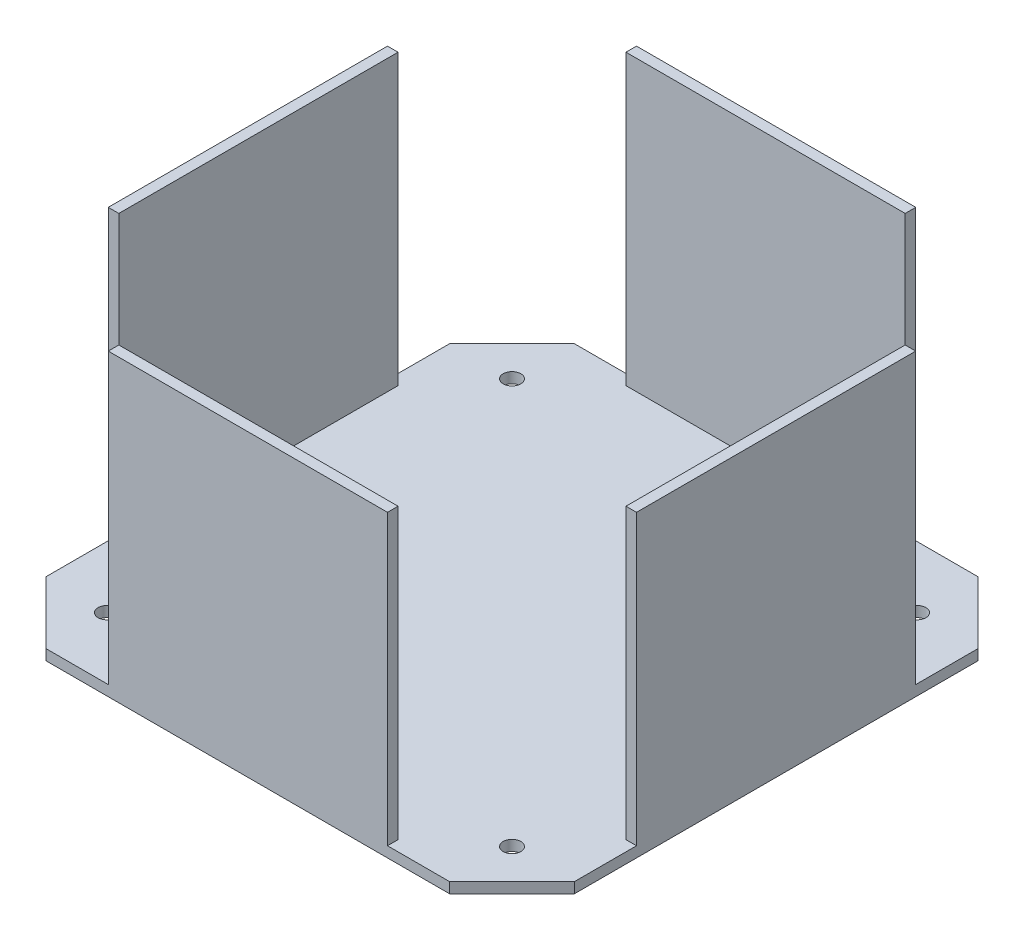
ISO-10303-21;
HEADER;
FILE_DESCRIPTION(('STEP AP214'),'2;1');
FILE_NAME('part.step','',(''),(''),'','','');
FILE_SCHEMA(('AUTOMOTIVE_DESIGN { 1 0 10303 214 1 1 1 1 }'));
ENDSEC;
DATA;
#1=APPLICATION_CONTEXT('core data for automotive mechanical design processes');
#2=APPLICATION_PROTOCOL_DEFINITION('international standard','automotive_design',2000,#1);
#3=PRODUCT_CONTEXT('',#1,'mechanical');
#4=PRODUCT('Part','Part','',(#3));
#5=PRODUCT_RELATED_PRODUCT_CATEGORY('part','',(#4));
#6=PRODUCT_DEFINITION_FORMATION('','',#4);
#7=PRODUCT_DEFINITION_CONTEXT('part definition',#1,'design');
#8=PRODUCT_DEFINITION('design','',#6,#7);
#9=PRODUCT_DEFINITION_SHAPE('','',#8);
#10=(LENGTH_UNIT() NAMED_UNIT(*) SI_UNIT(.MILLI.,.METRE.));
#11=(NAMED_UNIT(*) PLANE_ANGLE_UNIT() SI_UNIT($,.RADIAN.));
#12=(NAMED_UNIT(*) SI_UNIT($,.STERADIAN.) SOLID_ANGLE_UNIT());
#13=UNCERTAINTY_MEASURE_WITH_UNIT(LENGTH_MEASURE(1.E-05),#10,'distance_accuracy_value','');
#14=(GEOMETRIC_REPRESENTATION_CONTEXT(3) GLOBAL_UNCERTAINTY_ASSIGNED_CONTEXT((#13)) GLOBAL_UNIT_ASSIGNED_CONTEXT((#10,
#11,#12)) REPRESENTATION_CONTEXT('',''));
#15=CARTESIAN_POINT('',(0.,0.,0.));
#16=DIRECTION('',(0.,0.,1.));
#17=DIRECTION('',(1.,0.,0.));
#18=AXIS2_PLACEMENT_3D('',#15,#16,#17);
#19=CARTESIAN_POINT('',(0.,85.,0.));
#20=DIRECTION('',(0.,1.,0.));
#21=DIRECTION('',(0.,0.,1.));
#22=AXIS2_PLACEMENT_3D('',#19,#20,#21);
#23=PLANE('',#22);
#24=DIRECTION('',(1.,0.,0.));
#25=VECTOR('',#24,1.);
#26=CARTESIAN_POINT('',(75.,85.,-39.6446609406726));
#27=LINE('',#26,#25);
#28=CARTESIAN_POINT('',(72.,85.,-39.6446609406726));
#29=VERTEX_POINT('',#28);
#30=CARTESIAN_POINT('',(75.,85.,-39.6446609406726));
#31=VERTEX_POINT('',#30);
#32=EDGE_CURVE('E229',#29,#31,#27,.T.);
#33=ORIENTED_EDGE('',*,*,#32,.F.);
#34=DIRECTION('',(0.,0.,-1.));
#35=VECTOR('',#34,1.);
#36=CARTESIAN_POINT('',(72.,85.,75.));
#37=LINE('',#36,#35);
#38=CARTESIAN_POINT('',(72.,85.,39.6446609406727));
#39=VERTEX_POINT('',#38);
#40=EDGE_CURVE('E317',#39,#29,#37,.T.);
#41=ORIENTED_EDGE('',*,*,#40,.F.);
#42=DIRECTION('',(-1.,0.,0.));
#43=VECTOR('',#42,1.);
#44=CARTESIAN_POINT('',(75.,85.,39.6446609406727));
#45=LINE('',#44,#43);
#46=CARTESIAN_POINT('',(75.,85.,39.6446609406727));
#47=VERTEX_POINT('',#46);
#48=EDGE_CURVE('E287',#47,#39,#45,.T.);
#49=ORIENTED_EDGE('',*,*,#48,.F.);
#50=DIRECTION('',(0.,0.,-1.));
#51=VECTOR('',#50,1.);
#52=CARTESIAN_POINT('',(75.,85.,75.));
#53=LINE('',#52,#51);
#54=EDGE_CURVE('E48',#47,#31,#53,.T.);
#55=ORIENTED_EDGE('',*,*,#54,.T.);
#56=EDGE_LOOP('',(#33,#41,#49,#55));
#57=FACE_BOUND('',#56,.T.);
#58=ADVANCED_FACE('F39',(#57),#23,.T.);
#59=DIRECTION('',(0.,0.,1.));
#60=VECTOR('',#59,1.);
#61=CARTESIAN_POINT('',(39.6446609406727,85.,-75.));
#62=LINE('',#61,#60);
#63=CARTESIAN_POINT('',(39.6446609406727,85.,-75.));
#64=VERTEX_POINT('',#63);
#65=CARTESIAN_POINT('',(39.6446609406727,85.,-72.));
#66=VERTEX_POINT('',#65);
#67=EDGE_CURVE('E233',#64,#66,#62,.T.);
#68=ORIENTED_EDGE('',*,*,#67,.F.);
#69=DIRECTION('',(-1.,0.,0.));
#70=VECTOR('',#69,1.);
#71=CARTESIAN_POINT('',(75.,85.,-75.));
#72=LINE('',#71,#70);
#73=CARTESIAN_POINT('',(-39.6446609406726,85.,-75.));
#74=VERTEX_POINT('',#73);
#75=EDGE_CURVE('E11',#64,#74,#72,.T.);
#76=ORIENTED_EDGE('',*,*,#75,.T.);
#77=DIRECTION('',(0.,0.,-1.));
#78=VECTOR('',#77,1.);
#79=CARTESIAN_POINT('',(-39.6446609406726,85.,-75.));
#80=LINE('',#79,#78);
#81=CARTESIAN_POINT('',(-39.6446609406725,85.,-72.));
#82=VERTEX_POINT('',#81);
#83=EDGE_CURVE('E251',#82,#74,#80,.T.);
#84=ORIENTED_EDGE('',*,*,#83,.F.);
#85=DIRECTION('',(-1.,0.,0.));
#86=VECTOR('',#85,1.);
#87=CARTESIAN_POINT('',(75.,85.,-72.));
#88=LINE('',#87,#86);
#89=EDGE_CURVE('E320',#66,#82,#88,.T.);
#90=ORIENTED_EDGE('',*,*,#89,.F.);
#91=EDGE_LOOP('',(#68,#76,#84,#90));
#92=FACE_BOUND('',#91,.T.);
#93=ADVANCED_FACE('F434',(#92),#23,.T.);
#94=DIRECTION('',(1.,0.,0.));
#95=VECTOR('',#94,1.);
#96=CARTESIAN_POINT('',(-75.,85.,-39.6446609406727));
#97=LINE('',#96,#95);
#98=CARTESIAN_POINT('',(-75.,85.,-39.6446609406727));
#99=VERTEX_POINT('',#98);
#100=CARTESIAN_POINT('',(-72.,85.,-39.6446609406727));
#101=VERTEX_POINT('',#100);
#102=EDGE_CURVE('E241',#99,#101,#97,.T.);
#103=ORIENTED_EDGE('',*,*,#102,.F.);
#104=DIRECTION('',(0.,0.,1.));
#105=VECTOR('',#104,1.);
#106=CARTESIAN_POINT('',(-75.,85.,75.));
#107=LINE('',#106,#105);
#108=CARTESIAN_POINT('',(-75.,85.,39.6446609406726));
#109=VERTEX_POINT('',#108);
#110=EDGE_CURVE('E324',#99,#109,#107,.T.);
#111=ORIENTED_EDGE('',*,*,#110,.T.);
#112=DIRECTION('',(-1.,0.,0.));
#113=VECTOR('',#112,1.);
#114=CARTESIAN_POINT('',(-75.,85.,39.6446609406726));
#115=LINE('',#114,#113);
#116=CARTESIAN_POINT('',(-72.,85.,39.6446609406725));
#117=VERTEX_POINT('',#116);
#118=EDGE_CURVE('E288',#117,#109,#115,.T.);
#119=ORIENTED_EDGE('',*,*,#118,.F.);
#120=DIRECTION('',(0.,0.,1.));
#121=VECTOR('',#120,1.);
#122=CARTESIAN_POINT('',(-72.,85.,75.));
#123=LINE('',#122,#121);
#124=EDGE_CURVE('E311',#101,#117,#123,.T.);
#125=ORIENTED_EDGE('',*,*,#124,.F.);
#126=EDGE_LOOP('',(#103,#111,#119,#125));
#127=FACE_BOUND('',#126,.T.);
#128=ADVANCED_FACE('F440',(#127),#23,.T.);
#129=CARTESIAN_POINT('',(-75.,85.,75.));
#130=DIRECTION('',(1.,0.,0.));
#131=DIRECTION('',(0.,0.,-1.));
#132=AXIS2_PLACEMENT_3D('',#129,#130,#131);
#133=PLANE('',#132);
#134=DIRECTION('',(0.,0.,-1.));
#135=VECTOR('',#134,1.);
#136=CARTESIAN_POINT('',(-75.,3.,-75.));
#137=LINE('',#136,#135);
#138=CARTESIAN_POINT('',(-75.,3.,-39.6446609406727));
#139=VERTEX_POINT('',#138);
#140=CARTESIAN_POINT('',(-75.,3.,-57.3223304703363));
#141=VERTEX_POINT('',#140);
#142=EDGE_CURVE('E249',#139,#141,#137,.T.);
#143=ORIENTED_EDGE('',*,*,#142,.T.);
#144=DIRECTION('',(0.,1.,0.));
#145=VECTOR('',#144,1.);
#146=CARTESIAN_POINT('',(-75.,0.,-57.3223304703363));
#147=LINE('',#146,#145);
#148=CARTESIAN_POINT('',(-75.,0.,-57.3223304703363));
#149=VERTEX_POINT('',#148);
#150=EDGE_CURVE('E207',#149,#141,#147,.T.);
#151=ORIENTED_EDGE('',*,*,#150,.F.);
#152=DIRECTION('',(0.,0.,1.));
#153=VECTOR('',#152,1.);
#154=CARTESIAN_POINT('',(-75.,0.,75.));
#155=LINE('',#154,#153);
#156=CARTESIAN_POINT('',(-75.,0.,57.3223304703363));
#157=VERTEX_POINT('',#156);
#158=EDGE_CURVE('E323',#149,#157,#155,.T.);
#159=ORIENTED_EDGE('',*,*,#158,.T.);
#160=DIRECTION('',(0.,1.,0.));
#161=VECTOR('',#160,1.);
#162=CARTESIAN_POINT('',(-75.,0.,57.3223304703363));
#163=LINE('',#162,#161);
#164=CARTESIAN_POINT('',(-75.,3.,57.3223304703363));
#165=VERTEX_POINT('',#164);
#166=EDGE_CURVE('E367',#157,#165,#163,.T.);
#167=ORIENTED_EDGE('',*,*,#166,.T.);
#168=DIRECTION('',(0.,0.,-1.));
#169=VECTOR('',#168,1.);
#170=CARTESIAN_POINT('',(-75.,3.,39.6446609406726));
#171=LINE('',#170,#169);
#172=CARTESIAN_POINT('',(-75.,3.,39.6446609406726));
#173=VERTEX_POINT('',#172);
#174=EDGE_CURVE('E252',#165,#173,#171,.T.);
#175=ORIENTED_EDGE('',*,*,#174,.T.);
#176=DIRECTION('',(0.,1.,0.));
#177=VECTOR('',#176,1.);
#178=CARTESIAN_POINT('',(-75.,-47.,39.6446609406726));
#179=LINE('',#178,#177);
#180=EDGE_CURVE('E374',#173,#109,#179,.T.);
#181=ORIENTED_EDGE('',*,*,#180,.T.);
#182=ORIENTED_EDGE('',*,*,#110,.F.);
#183=DIRECTION('',(0.,1.,0.));
#184=VECTOR('',#183,1.);
#185=CARTESIAN_POINT('',(-75.,-47.,-39.6446609406727));
#186=LINE('',#185,#184);
#187=EDGE_CURVE('E242',#139,#99,#186,.T.);
#188=ORIENTED_EDGE('',*,*,#187,.F.);
#189=EDGE_LOOP('',(#143,#151,#159,#167,#175,#181,#182,#188));
#190=FACE_BOUND('',#189,.T.);
#191=ADVANCED_FACE('F41',(#190),#133,.F.);
#192=CARTESIAN_POINT('',(75.,85.,75.));
#193=DIRECTION('',(0.,0.,-1.));
#194=DIRECTION('',(-1.,0.,0.));
#195=AXIS2_PLACEMENT_3D('',#192,#193,#194);
#196=PLANE('',#195);
#197=DIRECTION('',(1.,0.,0.));
#198=VECTOR('',#197,1.);
#199=CARTESIAN_POINT('',(75.,0.,75.));
#200=LINE('',#199,#198);
#201=CARTESIAN_POINT('',(-57.3223304703363,0.,75.));
#202=VERTEX_POINT('',#201);
#203=CARTESIAN_POINT('',(57.3223304703363,0.,75.));
#204=VERTEX_POINT('',#203);
#205=EDGE_CURVE('E334',#202,#204,#200,.T.);
#206=ORIENTED_EDGE('',*,*,#205,.T.);
#207=DIRECTION('',(0.,1.,0.));
#208=VECTOR('',#207,1.);
#209=CARTESIAN_POINT('',(57.3223304703363,0.,75.));
#210=LINE('',#209,#208);
#211=CARTESIAN_POINT('',(57.3223304703363,3.,75.));
#212=VERTEX_POINT('',#211);
#213=EDGE_CURVE('E357',#204,#212,#210,.T.);
#214=ORIENTED_EDGE('',*,*,#213,.T.);
#215=DIRECTION('',(-1.,0.,0.));
#216=VECTOR('',#215,1.);
#217=CARTESIAN_POINT('',(39.6446609406725,3.,75.));
#218=LINE('',#217,#216);
#219=CARTESIAN_POINT('',(39.6446609406725,3.,75.));
#220=VERTEX_POINT('',#219);
#221=EDGE_CURVE('E284',#212,#220,#218,.T.);
#222=ORIENTED_EDGE('',*,*,#221,.T.);
#223=DIRECTION('',(0.,1.,0.));
#224=VECTOR('',#223,1.);
#225=CARTESIAN_POINT('',(39.6446609406725,-47.,75.));
#226=LINE('',#225,#224);
#227=CARTESIAN_POINT('',(39.6446609406725,85.,75.));
#228=VERTEX_POINT('',#227);
#229=EDGE_CURVE('E290',#220,#228,#226,.T.);
#230=ORIENTED_EDGE('',*,*,#229,.T.);
#231=DIRECTION('',(1.,0.,0.));
#232=VECTOR('',#231,1.);
#233=CARTESIAN_POINT('',(75.,85.,75.));
#234=LINE('',#233,#232);
#235=CARTESIAN_POINT('',(-39.6446609406727,85.,75.));
#236=VERTEX_POINT('',#235);
#237=EDGE_CURVE('E327',#236,#228,#234,.T.);
#238=ORIENTED_EDGE('',*,*,#237,.F.);
#239=DIRECTION('',(0.,1.,0.));
#240=VECTOR('',#239,1.);
#241=CARTESIAN_POINT('',(-39.6446609406727,-47.,75.));
#242=LINE('',#241,#240);
#243=CARTESIAN_POINT('',(-39.6446609406727,3.,75.));
#244=VERTEX_POINT('',#243);
#245=EDGE_CURVE('E378',#244,#236,#242,.T.);
#246=ORIENTED_EDGE('',*,*,#245,.F.);
#247=DIRECTION('',(-1.,0.,0.));
#248=VECTOR('',#247,1.);
#249=CARTESIAN_POINT('',(-75.,3.,75.));
#250=LINE('',#249,#248);
#251=CARTESIAN_POINT('',(-57.3223304703363,3.,75.));
#252=VERTEX_POINT('',#251);
#253=EDGE_CURVE('E237',#244,#252,#250,.T.);
#254=ORIENTED_EDGE('',*,*,#253,.T.);
#255=DIRECTION('',(0.,1.,0.));
#256=VECTOR('',#255,1.);
#257=CARTESIAN_POINT('',(-57.3223304703363,0.,75.));
#258=LINE('',#257,#256);
#259=EDGE_CURVE('E259',#202,#252,#258,.T.);
#260=ORIENTED_EDGE('',*,*,#259,.F.);
#261=EDGE_LOOP('',(#206,#214,#222,#230,#238,#246,#254,#260));
#262=FACE_BOUND('',#261,.T.);
#263=ADVANCED_FACE('F395',(#262),#196,.F.);
#264=CARTESIAN_POINT('',(75.,85.,75.));
#265=DIRECTION('',(-1.,0.,0.));
#266=DIRECTION('',(0.,0.,1.));
#267=AXIS2_PLACEMENT_3D('',#264,#265,#266);
#268=PLANE('',#267);
#269=DIRECTION('',(0.,0.,1.));
#270=VECTOR('',#269,1.);
#271=CARTESIAN_POINT('',(75.,3.,75.));
#272=LINE('',#271,#270);
#273=CARTESIAN_POINT('',(75.,3.,39.6446609406727));
#274=VERTEX_POINT('',#273);
#275=CARTESIAN_POINT('',(75.,3.,57.3223304703363));
#276=VERTEX_POINT('',#275);
#277=EDGE_CURVE('E276',#274,#276,#272,.T.);
#278=ORIENTED_EDGE('',*,*,#277,.T.);
#279=DIRECTION('',(0.,1.,0.));
#280=VECTOR('',#279,1.);
#281=CARTESIAN_POINT('',(75.,0.,57.3223304703363));
#282=LINE('',#281,#280);
#283=CARTESIAN_POINT('',(75.,0.,57.3223304703363));
#284=VERTEX_POINT('',#283);
#285=EDGE_CURVE('E64',#284,#276,#282,.T.);
#286=ORIENTED_EDGE('',*,*,#285,.F.);
#287=DIRECTION('',(0.,0.,-1.));
#288=VECTOR('',#287,1.);
#289=CARTESIAN_POINT('',(75.,0.,75.));
#290=LINE('',#289,#288);
#291=CARTESIAN_POINT('',(75.,0.,-57.3223304703363));
#292=VERTEX_POINT('',#291);
#293=EDGE_CURVE('E336',#284,#292,#290,.T.);
#294=ORIENTED_EDGE('',*,*,#293,.T.);
#295=DIRECTION('',(0.,1.,0.));
#296=VECTOR('',#295,1.);
#297=CARTESIAN_POINT('',(75.,0.,-57.3223304703363));
#298=LINE('',#297,#296);
#299=CARTESIAN_POINT('',(75.,3.,-57.3223304703363));
#300=VERTEX_POINT('',#299);
#301=EDGE_CURVE('E342',#292,#300,#298,.T.);
#302=ORIENTED_EDGE('',*,*,#301,.T.);
#303=DIRECTION('',(0.,0.,1.));
#304=VECTOR('',#303,1.);
#305=CARTESIAN_POINT('',(75.,3.,-39.6446609406726));
#306=LINE('',#305,#304);
#307=CARTESIAN_POINT('',(75.,3.,-39.6446609406726));
#308=VERTEX_POINT('',#307);
#309=EDGE_CURVE('E256',#300,#308,#306,.T.);
#310=ORIENTED_EDGE('',*,*,#309,.T.);
#311=DIRECTION('',(0.,1.,0.));
#312=VECTOR('',#311,1.);
#313=CARTESIAN_POINT('',(75.,-47.,-39.6446609406726));
#314=LINE('',#313,#312);
#315=EDGE_CURVE('E260',#308,#31,#314,.T.);
#316=ORIENTED_EDGE('',*,*,#315,.T.);
#317=ORIENTED_EDGE('',*,*,#54,.F.);
#318=DIRECTION('',(0.,1.,0.));
#319=VECTOR('',#318,1.);
#320=CARTESIAN_POINT('',(75.,-47.,39.6446609406727));
#321=LINE('',#320,#319);
#322=EDGE_CURVE('E295',#274,#47,#321,.T.);
#323=ORIENTED_EDGE('',*,*,#322,.F.);
#324=EDGE_LOOP('',(#278,#286,#294,#302,#310,#316,#317,#323));
#325=FACE_BOUND('',#324,.T.);
#326=ADVANCED_FACE('F341',(#325),#268,.F.);
#327=CARTESIAN_POINT('',(75.,85.,-75.));
#328=DIRECTION('',(0.,0.,1.));
#329=DIRECTION('',(1.,0.,0.));
#330=AXIS2_PLACEMENT_3D('',#327,#328,#329);
#331=PLANE('',#330);
#332=DIRECTION('',(1.,0.,0.));
#333=VECTOR('',#332,1.);
#334=CARTESIAN_POINT('',(75.,3.,-75.));
#335=LINE('',#334,#333);
#336=CARTESIAN_POINT('',(39.6446609406727,3.,-75.));
#337=VERTEX_POINT('',#336);
#338=CARTESIAN_POINT('',(57.3223304703363,3.,-75.));
#339=VERTEX_POINT('',#338);
#340=EDGE_CURVE('E270',#337,#339,#335,.T.);
#341=ORIENTED_EDGE('',*,*,#340,.T.);
#342=DIRECTION('',(0.,1.,0.));
#343=VECTOR('',#342,1.);
#344=CARTESIAN_POINT('',(57.3223304703363,0.,-75.));
#345=LINE('',#344,#343);
#346=CARTESIAN_POINT('',(57.3223304703363,0.,-75.));
#347=VERTEX_POINT('',#346);
#348=EDGE_CURVE('E56',#347,#339,#345,.T.);
#349=ORIENTED_EDGE('',*,*,#348,.F.);
#350=DIRECTION('',(-1.,0.,0.));
#351=VECTOR('',#350,1.);
#352=CARTESIAN_POINT('',(75.,0.,-75.));
#353=LINE('',#352,#351);
#354=CARTESIAN_POINT('',(-57.3223304703362,0.,-75.));
#355=VERTEX_POINT('',#354);
#356=EDGE_CURVE('E43',#347,#355,#353,.T.);
#357=ORIENTED_EDGE('',*,*,#356,.T.);
#358=DIRECTION('',(0.,1.,0.));
#359=VECTOR('',#358,1.);
#360=CARTESIAN_POINT('',(-57.3223304703362,0.,-75.));
#361=LINE('',#360,#359);
#362=CARTESIAN_POINT('',(-57.3223304703362,3.,-75.));
#363=VERTEX_POINT('',#362);
#364=EDGE_CURVE('E204',#355,#363,#361,.T.);
#365=ORIENTED_EDGE('',*,*,#364,.T.);
#366=DIRECTION('',(1.,0.,0.));
#367=VECTOR('',#366,1.);
#368=CARTESIAN_POINT('',(-39.6446609406726,3.,-75.));
#369=LINE('',#368,#367);
#370=CARTESIAN_POINT('',(-39.6446609406726,3.,-75.));
#371=VERTEX_POINT('',#370);
#372=EDGE_CURVE('E220',#363,#371,#369,.T.);
#373=ORIENTED_EDGE('',*,*,#372,.T.);
#374=DIRECTION('',(0.,1.,0.));
#375=VECTOR('',#374,1.);
#376=CARTESIAN_POINT('',(-39.6446609406726,-47.,-75.));
#377=LINE('',#376,#375);
#378=EDGE_CURVE('E239',#371,#74,#377,.T.);
#379=ORIENTED_EDGE('',*,*,#378,.T.);
#380=ORIENTED_EDGE('',*,*,#75,.F.);
#381=DIRECTION('',(0.,1.,0.));
#382=VECTOR('',#381,1.);
#383=CARTESIAN_POINT('',(39.6446609406727,-47.,-75.));
#384=LINE('',#383,#382);
#385=EDGE_CURVE('E263',#337,#64,#384,.T.);
#386=ORIENTED_EDGE('',*,*,#385,.F.);
#387=EDGE_LOOP('',(#341,#349,#357,#365,#373,#379,#380,#386));
#388=FACE_BOUND('',#387,.T.);
#389=ADVANCED_FACE('F218',(#388),#331,.F.);
#390=DIRECTION('',(0.,0.,-1.));
#391=VECTOR('',#390,1.);
#392=CARTESIAN_POINT('',(-39.6446609406727,85.,75.));
#393=LINE('',#392,#391);
#394=CARTESIAN_POINT('',(-39.6446609406727,85.,72.));
#395=VERTEX_POINT('',#394);
#396=EDGE_CURVE('E377',#236,#395,#393,.T.);
#397=ORIENTED_EDGE('',*,*,#396,.F.);
#398=ORIENTED_EDGE('',*,*,#237,.T.);
#399=DIRECTION('',(0.,0.,1.));
#400=VECTOR('',#399,1.);
#401=CARTESIAN_POINT('',(39.6446609406725,85.,75.));
#402=LINE('',#401,#400);
#403=CARTESIAN_POINT('',(39.6446609406725,85.,72.));
#404=VERTEX_POINT('',#403);
#405=EDGE_CURVE('E285',#404,#228,#402,.T.);
#406=ORIENTED_EDGE('',*,*,#405,.F.);
#407=DIRECTION('',(1.,0.,0.));
#408=VECTOR('',#407,1.);
#409=CARTESIAN_POINT('',(75.,85.,72.));
#410=LINE('',#409,#408);
#411=EDGE_CURVE('E314',#395,#404,#410,.T.);
#412=ORIENTED_EDGE('',*,*,#411,.F.);
#413=EDGE_LOOP('',(#397,#398,#406,#412));
#414=FACE_BOUND('',#413,.T.);
#415=ADVANCED_FACE('F415',(#414),#23,.T.);
#416=CARTESIAN_POINT('',(0.,0.,0.));
#417=DIRECTION('',(0.,1.,0.));
#418=DIRECTION('',(0.,0.,1.));
#419=AXIS2_PLACEMENT_3D('',#416,#417,#418);
#420=PLANE('',#419);
#421=CARTESIAN_POINT('',(-57.5115465263435,0.,-57.5115465263436));
#422=DIRECTION('',(0.,1.,0.));
#423=DIRECTION('',(0.,0.,1.));
#424=AXIS2_PLACEMENT_3D('',#421,#422,#423);
#425=CIRCLE('',#424,2.5);
#426=CARTESIAN_POINT('',(-57.5115465263435,0.,-55.0115465263436));
#427=VERTEX_POINT('',#426);
#428=EDGE_CURVE('E527',#427,#427,#425,.T.);
#429=ORIENTED_EDGE('',*,*,#428,.T.);
#430=EDGE_LOOP('',(#429));
#431=FACE_BOUND('',#430,.T.);
#432=CARTESIAN_POINT('',(-57.5115465263436,0.,57.5115465263435));
#433=DIRECTION('',(0.,1.,0.));
#434=DIRECTION('',(0.,0.,1.));
#435=AXIS2_PLACEMENT_3D('',#432,#433,#434);
#436=CIRCLE('',#435,2.5);
#437=CARTESIAN_POINT('',(-57.5115465263436,0.,60.0115465263435));
#438=VERTEX_POINT('',#437);
#439=EDGE_CURVE('E531',#438,#438,#436,.T.);
#440=ORIENTED_EDGE('',*,*,#439,.T.);
#441=EDGE_LOOP('',(#440));
#442=FACE_BOUND('',#441,.T.);
#443=CARTESIAN_POINT('',(57.5115465263435,0.,57.5115465263436));
#444=DIRECTION('',(0.,1.,0.));
#445=DIRECTION('',(0.,0.,1.));
#446=AXIS2_PLACEMENT_3D('',#443,#444,#445);
#447=CIRCLE('',#446,2.5);
#448=CARTESIAN_POINT('',(57.5115465263435,0.,60.0115465263436));
#449=VERTEX_POINT('',#448);
#450=EDGE_CURVE('E522',#449,#449,#447,.T.);
#451=ORIENTED_EDGE('',*,*,#450,.T.);
#452=EDGE_LOOP('',(#451));
#453=FACE_BOUND('',#452,.T.);
#454=CARTESIAN_POINT('',(57.5115465263436,0.,-57.5115465263435));
#455=DIRECTION('',(0.,1.,0.));
#456=DIRECTION('',(0.,0.,1.));
#457=AXIS2_PLACEMENT_3D('',#454,#455,#456);
#458=CIRCLE('',#457,2.5);
#459=CARTESIAN_POINT('',(57.5115465263436,0.,-55.0115465263435));
#460=VERTEX_POINT('',#459);
#461=EDGE_CURVE('E360',#460,#460,#458,.T.);
#462=ORIENTED_EDGE('',*,*,#461,.T.);
#463=EDGE_LOOP('',(#462));
#464=FACE_BOUND('',#463,.T.);
#465=ORIENTED_EDGE('',*,*,#293,.F.);
#466=DIRECTION('',(-0.707106781186549,0.,0.707106781186546));
#467=VECTOR('',#466,1.);
#468=CARTESIAN_POINT('',(75.,0.,57.3223304703363));
#469=LINE('',#468,#467);
#470=EDGE_CURVE('E349',#284,#204,#469,.T.);
#471=ORIENTED_EDGE('',*,*,#470,.T.);
#472=ORIENTED_EDGE('',*,*,#205,.F.);
#473=DIRECTION('',(-0.707106781186546,0.,-0.707106781186549));
#474=VECTOR('',#473,1.);
#475=CARTESIAN_POINT('',(-57.3223304703363,0.,75.));
#476=LINE('',#475,#474);
#477=EDGE_CURVE('E364',#202,#157,#476,.T.);
#478=ORIENTED_EDGE('',*,*,#477,.T.);
#479=ORIENTED_EDGE('',*,*,#158,.F.);
#480=DIRECTION('',(0.707106781186549,0.,-0.707106781186546));
#481=VECTOR('',#480,1.);
#482=CARTESIAN_POINT('',(-75.,0.,-57.3223304703363));
#483=LINE('',#482,#481);
#484=EDGE_CURVE('E213',#149,#355,#483,.T.);
#485=ORIENTED_EDGE('',*,*,#484,.T.);
#486=ORIENTED_EDGE('',*,*,#356,.F.);
#487=DIRECTION('',(0.707106781186546,0.,0.707106781186549));
#488=VECTOR('',#487,1.);
#489=CARTESIAN_POINT('',(57.3223304703363,0.,-75.));
#490=LINE('',#489,#488);
#491=EDGE_CURVE('E350',#347,#292,#490,.T.);
#492=ORIENTED_EDGE('',*,*,#491,.T.);
#493=EDGE_LOOP('',(#465,#471,#472,#478,#479,#485,#486,#492));
#494=FACE_BOUND('',#493,.T.);
#495=ADVANCED_FACE('F347',(#431,#442,#453,#464,#494),#420,.F.);
#496=CARTESIAN_POINT('',(-72.,85.,75.));
#497=DIRECTION('',(1.,0.,0.));
#498=DIRECTION('',(0.,0.,-1.));
#499=AXIS2_PLACEMENT_3D('',#496,#497,#498);
#500=PLANE('',#499);
#501=DIRECTION('',(0.,1.,0.));
#502=VECTOR('',#501,1.);
#503=CARTESIAN_POINT('',(-72.,-47.,-39.6446609406727));
#504=LINE('',#503,#502);
#505=CARTESIAN_POINT('',(-72.,3.,-39.6446609406727));
#506=VERTEX_POINT('',#505);
#507=EDGE_CURVE('E244',#506,#101,#504,.T.);
#508=ORIENTED_EDGE('',*,*,#507,.T.);
#509=ORIENTED_EDGE('',*,*,#124,.T.);
#510=DIRECTION('',(0.,1.,0.));
#511=VECTOR('',#510,1.);
#512=CARTESIAN_POINT('',(-72.,-47.,39.6446609406725));
#513=LINE('',#512,#511);
#514=CARTESIAN_POINT('',(-72.,3.,39.6446609406725));
#515=VERTEX_POINT('',#514);
#516=EDGE_CURVE('E383',#515,#117,#513,.T.);
#517=ORIENTED_EDGE('',*,*,#516,.F.);
#518=DIRECTION('',(0.,0.,1.));
#519=VECTOR('',#518,1.);
#520=CARTESIAN_POINT('',(-72.,3.,75.));
#521=LINE('',#520,#519);
#522=EDGE_CURVE('E300',#506,#515,#521,.T.);
#523=ORIENTED_EDGE('',*,*,#522,.F.);
#524=EDGE_LOOP('',(#508,#509,#517,#523));
#525=FACE_BOUND('',#524,.T.);
#526=ADVANCED_FACE('F422',(#525),#500,.T.);
#527=CARTESIAN_POINT('',(75.,85.,72.));
#528=DIRECTION('',(0.,0.,-1.));
#529=DIRECTION('',(-1.,0.,0.));
#530=AXIS2_PLACEMENT_3D('',#527,#528,#529);
#531=PLANE('',#530);
#532=DIRECTION('',(0.,1.,0.));
#533=VECTOR('',#532,1.);
#534=CARTESIAN_POINT('',(-39.6446609406727,-47.,72.));
#535=LINE('',#534,#533);
#536=CARTESIAN_POINT('',(-39.6446609406727,3.,72.));
#537=VERTEX_POINT('',#536);
#538=EDGE_CURVE('E380',#537,#395,#535,.T.);
#539=ORIENTED_EDGE('',*,*,#538,.T.);
#540=ORIENTED_EDGE('',*,*,#411,.T.);
#541=DIRECTION('',(0.,1.,0.));
#542=VECTOR('',#541,1.);
#543=CARTESIAN_POINT('',(39.6446609406725,-47.,72.));
#544=LINE('',#543,#542);
#545=CARTESIAN_POINT('',(39.6446609406725,3.,72.));
#546=VERTEX_POINT('',#545);
#547=EDGE_CURVE('E280',#546,#404,#544,.T.);
#548=ORIENTED_EDGE('',*,*,#547,.F.);
#549=DIRECTION('',(1.,0.,0.));
#550=VECTOR('',#549,1.);
#551=CARTESIAN_POINT('',(75.,3.,72.));
#552=LINE('',#551,#550);
#553=EDGE_CURVE('E303',#537,#546,#552,.T.);
#554=ORIENTED_EDGE('',*,*,#553,.F.);
#555=EDGE_LOOP('',(#539,#540,#548,#554));
#556=FACE_BOUND('',#555,.T.);
#557=ADVANCED_FACE('F419',(#556),#531,.T.);
#558=CARTESIAN_POINT('',(72.,85.,75.));
#559=DIRECTION('',(-1.,0.,0.));
#560=DIRECTION('',(0.,0.,1.));
#561=AXIS2_PLACEMENT_3D('',#558,#559,#560);
#562=PLANE('',#561);
#563=DIRECTION('',(0.,1.,0.));
#564=VECTOR('',#563,1.);
#565=CARTESIAN_POINT('',(72.,-47.,-39.6446609406726));
#566=LINE('',#565,#564);
#567=CARTESIAN_POINT('',(72.,3.,-39.6446609406726));
#568=VERTEX_POINT('',#567);
#569=EDGE_CURVE('E268',#568,#29,#566,.T.);
#570=ORIENTED_EDGE('',*,*,#569,.F.);
#571=DIRECTION('',(0.,0.,-1.));
#572=VECTOR('',#571,1.);
#573=CARTESIAN_POINT('',(72.,3.,75.));
#574=LINE('',#573,#572);
#575=CARTESIAN_POINT('',(72.,3.,39.6446609406727));
#576=VERTEX_POINT('',#575);
#577=EDGE_CURVE('E306',#576,#568,#574,.T.);
#578=ORIENTED_EDGE('',*,*,#577,.F.);
#579=DIRECTION('',(0.,1.,0.));
#580=VECTOR('',#579,1.);
#581=CARTESIAN_POINT('',(72.,-47.,39.6446609406727));
#582=LINE('',#581,#580);
#583=EDGE_CURVE('E292',#576,#39,#582,.T.);
#584=ORIENTED_EDGE('',*,*,#583,.T.);
#585=ORIENTED_EDGE('',*,*,#40,.T.);
#586=EDGE_LOOP('',(#570,#578,#584,#585));
#587=FACE_BOUND('',#586,.T.);
#588=ADVANCED_FACE('F421',(#587),#562,.T.);
#589=CARTESIAN_POINT('',(75.,85.,-72.));
#590=DIRECTION('',(0.,0.,1.));
#591=DIRECTION('',(1.,0.,0.));
#592=AXIS2_PLACEMENT_3D('',#589,#590,#591);
#593=PLANE('',#592);
#594=DIRECTION('',(0.,1.,0.));
#595=VECTOR('',#594,1.);
#596=CARTESIAN_POINT('',(39.6446609406727,-47.,-72.));
#597=LINE('',#596,#595);
#598=CARTESIAN_POINT('',(39.6446609406727,3.,-72.));
#599=VERTEX_POINT('',#598);
#600=EDGE_CURVE('E265',#599,#66,#597,.T.);
#601=ORIENTED_EDGE('',*,*,#600,.T.);
#602=ORIENTED_EDGE('',*,*,#89,.T.);
#603=DIRECTION('',(0.,1.,0.));
#604=VECTOR('',#603,1.);
#605=CARTESIAN_POINT('',(-39.6446609406725,-47.,-72.));
#606=LINE('',#605,#604);
#607=CARTESIAN_POINT('',(-39.6446609406725,3.,-72.));
#608=VERTEX_POINT('',#607);
#609=EDGE_CURVE('E247',#608,#82,#606,.T.);
#610=ORIENTED_EDGE('',*,*,#609,.F.);
#611=DIRECTION('',(-1.,0.,0.));
#612=VECTOR('',#611,1.);
#613=CARTESIAN_POINT('',(75.,3.,-72.));
#614=LINE('',#613,#612);
#615=EDGE_CURVE('E309',#599,#608,#614,.T.);
#616=ORIENTED_EDGE('',*,*,#615,.F.);
#617=EDGE_LOOP('',(#601,#602,#610,#616));
#618=FACE_BOUND('',#617,.T.);
#619=ADVANCED_FACE('F428',(#618),#593,.T.);
#620=CARTESIAN_POINT('',(0.,3.,0.));
#621=DIRECTION('',(0.,1.,0.));
#622=DIRECTION('',(0.,0.,1.));
#623=AXIS2_PLACEMENT_3D('',#620,#621,#622);
#624=PLANE('',#623);
#625=CARTESIAN_POINT('',(-57.5115465263435,3.,-57.5115465263436));
#626=DIRECTION('',(0.,1.,0.));
#627=DIRECTION('',(0.,0.,1.));
#628=AXIS2_PLACEMENT_3D('',#625,#626,#627);
#629=CIRCLE('',#628,2.5);
#630=CARTESIAN_POINT('',(-57.5115465263435,3.,-55.0115465263436));
#631=VERTEX_POINT('',#630);
#632=EDGE_CURVE('E506',#631,#631,#629,.T.);
#633=ORIENTED_EDGE('',*,*,#632,.F.);
#634=EDGE_LOOP('',(#633));
#635=FACE_BOUND('',#634,.T.);
#636=CARTESIAN_POINT('',(-57.5115465263436,3.,57.5115465263435));
#637=DIRECTION('',(0.,1.,0.));
#638=DIRECTION('',(0.,0.,1.));
#639=AXIS2_PLACEMENT_3D('',#636,#637,#638);
#640=CIRCLE('',#639,2.5);
#641=CARTESIAN_POINT('',(-57.5115465263436,3.,60.0115465263435));
#642=VERTEX_POINT('',#641);
#643=EDGE_CURVE('E510',#642,#642,#640,.T.);
#644=ORIENTED_EDGE('',*,*,#643,.F.);
#645=EDGE_LOOP('',(#644));
#646=FACE_BOUND('',#645,.T.);
#647=CARTESIAN_POINT('',(57.5115465263435,3.,57.5115465263436));
#648=DIRECTION('',(0.,1.,0.));
#649=DIRECTION('',(0.,0.,1.));
#650=AXIS2_PLACEMENT_3D('',#647,#648,#649);
#651=CIRCLE('',#650,2.5);
#652=CARTESIAN_POINT('',(57.5115465263435,3.,60.0115465263436));
#653=VERTEX_POINT('',#652);
#654=EDGE_CURVE('E514',#653,#653,#651,.T.);
#655=ORIENTED_EDGE('',*,*,#654,.F.);
#656=EDGE_LOOP('',(#655));
#657=FACE_BOUND('',#656,.T.);
#658=CARTESIAN_POINT('',(57.5115465263436,3.,-57.5115465263435));
#659=DIRECTION('',(0.,1.,0.));
#660=DIRECTION('',(0.,0.,1.));
#661=AXIS2_PLACEMENT_3D('',#658,#659,#660);
#662=CIRCLE('',#661,2.5);
#663=CARTESIAN_POINT('',(57.5115465263436,3.,-55.0115465263435));
#664=VERTEX_POINT('',#663);
#665=EDGE_CURVE('E517',#664,#664,#662,.T.);
#666=ORIENTED_EDGE('',*,*,#665,.F.);
#667=EDGE_LOOP('',(#666));
#668=FACE_BOUND('',#667,.T.);
#669=DIRECTION('',(-0.707106781186549,0.,0.707106781186546));
#670=VECTOR('',#669,1.);
#671=CARTESIAN_POINT('',(75.,3.,57.3223304703363));
#672=LINE('',#671,#670);
#673=EDGE_CURVE('E361',#276,#212,#672,.T.);
#674=ORIENTED_EDGE('',*,*,#673,.F.);
#675=ORIENTED_EDGE('',*,*,#277,.F.);
#676=DIRECTION('',(1.,0.,0.));
#677=VECTOR('',#676,1.);
#678=CARTESIAN_POINT('',(75.,3.,39.6446609406727));
#679=LINE('',#678,#677);
#680=EDGE_CURVE('E279',#576,#274,#679,.T.);
#681=ORIENTED_EDGE('',*,*,#680,.F.);
#682=ORIENTED_EDGE('',*,*,#577,.T.);
#683=DIRECTION('',(-1.,0.,0.));
#684=VECTOR('',#683,1.);
#685=CARTESIAN_POINT('',(75.,3.,-39.6446609406726));
#686=LINE('',#685,#684);
#687=EDGE_CURVE('E258',#308,#568,#686,.T.);
#688=ORIENTED_EDGE('',*,*,#687,.F.);
#689=ORIENTED_EDGE('',*,*,#309,.F.);
#690=DIRECTION('',(0.707106781186546,0.,0.707106781186549));
#691=VECTOR('',#690,1.);
#692=CARTESIAN_POINT('',(57.3223304703363,3.,-75.));
#693=LINE('',#692,#691);
#694=EDGE_CURVE('E223',#339,#300,#693,.T.);
#695=ORIENTED_EDGE('',*,*,#694,.F.);
#696=ORIENTED_EDGE('',*,*,#340,.F.);
#697=DIRECTION('',(0.,0.,-1.));
#698=VECTOR('',#697,1.);
#699=CARTESIAN_POINT('',(39.6446609406727,3.,-75.));
#700=LINE('',#699,#698);
#701=EDGE_CURVE('E273',#599,#337,#700,.T.);
#702=ORIENTED_EDGE('',*,*,#701,.F.);
#703=ORIENTED_EDGE('',*,*,#615,.T.);
#704=DIRECTION('',(0.,0.,1.));
#705=VECTOR('',#704,1.);
#706=CARTESIAN_POINT('',(-39.6446609406726,3.,-75.));
#707=LINE('',#706,#705);
#708=EDGE_CURVE('E227',#371,#608,#707,.T.);
#709=ORIENTED_EDGE('',*,*,#708,.F.);
#710=ORIENTED_EDGE('',*,*,#372,.F.);
#711=DIRECTION('',(0.707106781186549,0.,-0.707106781186546));
#712=VECTOR('',#711,1.);
#713=CARTESIAN_POINT('',(-75.,3.,-57.3223304703363));
#714=LINE('',#713,#712);
#715=EDGE_CURVE('E201',#141,#363,#714,.T.);
#716=ORIENTED_EDGE('',*,*,#715,.F.);
#717=ORIENTED_EDGE('',*,*,#142,.F.);
#718=DIRECTION('',(-1.,0.,0.));
#719=VECTOR('',#718,1.);
#720=CARTESIAN_POINT('',(-75.,3.,-39.6446609406727));
#721=LINE('',#720,#719);
#722=EDGE_CURVE('E231',#506,#139,#721,.T.);
#723=ORIENTED_EDGE('',*,*,#722,.F.);
#724=ORIENTED_EDGE('',*,*,#522,.T.);
#725=DIRECTION('',(1.,0.,0.));
#726=VECTOR('',#725,1.);
#727=CARTESIAN_POINT('',(-75.,3.,39.6446609406726));
#728=LINE('',#727,#726);
#729=EDGE_CURVE('E373',#173,#515,#728,.T.);
#730=ORIENTED_EDGE('',*,*,#729,.F.);
#731=ORIENTED_EDGE('',*,*,#174,.F.);
#732=DIRECTION('',(-0.707106781186546,0.,-0.707106781186549));
#733=VECTOR('',#732,1.);
#734=CARTESIAN_POINT('',(-57.3223304703363,3.,75.));
#735=LINE('',#734,#733);
#736=EDGE_CURVE('E212',#252,#165,#735,.T.);
#737=ORIENTED_EDGE('',*,*,#736,.F.);
#738=ORIENTED_EDGE('',*,*,#253,.F.);
#739=DIRECTION('',(0.,0.,1.));
#740=VECTOR('',#739,1.);
#741=CARTESIAN_POINT('',(-39.6446609406727,3.,75.));
#742=LINE('',#741,#740);
#743=EDGE_CURVE('E387',#537,#244,#742,.T.);
#744=ORIENTED_EDGE('',*,*,#743,.F.);
#745=ORIENTED_EDGE('',*,*,#553,.T.);
#746=DIRECTION('',(0.,0.,-1.));
#747=VECTOR('',#746,1.);
#748=CARTESIAN_POINT('',(39.6446609406725,3.,75.));
#749=LINE('',#748,#747);
#750=EDGE_CURVE('E282',#220,#546,#749,.T.);
#751=ORIENTED_EDGE('',*,*,#750,.F.);
#752=ORIENTED_EDGE('',*,*,#221,.F.);
#753=EDGE_LOOP('',(#674,#675,#681,#682,#688,#689,#695,#696,#702,#703,#709,#710,#716,#717,#723,
#724,#730,#731,#737,#738,#744,#745,#751,#752));
#754=FACE_BOUND('',#753,.T.);
#755=ADVANCED_FACE('F225',(#635,#646,#657,#668,#754),#624,.T.);
#756=CARTESIAN_POINT('',(39.6446609406725,-47.,75.));
#757=DIRECTION('',(-1.,0.,0.));
#758=DIRECTION('',(0.,0.,1.));
#759=AXIS2_PLACEMENT_3D('',#756,#757,#758);
#760=PLANE('',#759);
#761=ORIENTED_EDGE('',*,*,#750,.T.);
#762=ORIENTED_EDGE('',*,*,#547,.T.);
#763=ORIENTED_EDGE('',*,*,#405,.T.);
#764=ORIENTED_EDGE('',*,*,#229,.F.);
#765=EDGE_LOOP('',(#761,#762,#763,#764));
#766=FACE_BOUND('',#765,.T.);
#767=ADVANCED_FACE('F411',(#766),#760,.F.);
#768=CARTESIAN_POINT('',(75.,-47.,39.6446609406727));
#769=DIRECTION('',(0.,0.,-1.));
#770=DIRECTION('',(-1.,0.,0.));
#771=AXIS2_PLACEMENT_3D('',#768,#769,#770);
#772=PLANE('',#771);
#773=ORIENTED_EDGE('',*,*,#680,.T.);
#774=ORIENTED_EDGE('',*,*,#322,.T.);
#775=ORIENTED_EDGE('',*,*,#48,.T.);
#776=ORIENTED_EDGE('',*,*,#583,.F.);
#777=EDGE_LOOP('',(#773,#774,#775,#776));
#778=FACE_BOUND('',#777,.T.);
#779=ADVANCED_FACE('F488',(#778),#772,.F.);
#780=CARTESIAN_POINT('',(-75.,-47.,39.6446609406726));
#781=DIRECTION('',(0.,0.,-1.));
#782=DIRECTION('',(-1.,0.,0.));
#783=AXIS2_PLACEMENT_3D('',#780,#781,#782);
#784=PLANE('',#783);
#785=ORIENTED_EDGE('',*,*,#729,.T.);
#786=ORIENTED_EDGE('',*,*,#516,.T.);
#787=ORIENTED_EDGE('',*,*,#118,.T.);
#788=ORIENTED_EDGE('',*,*,#180,.F.);
#789=EDGE_LOOP('',(#785,#786,#787,#788));
#790=FACE_BOUND('',#789,.T.);
#791=ADVANCED_FACE('F465',(#790),#784,.F.);
#792=CARTESIAN_POINT('',(-39.6446609406727,-47.,75.));
#793=DIRECTION('',(1.,0.,0.));
#794=DIRECTION('',(0.,0.,-1.));
#795=AXIS2_PLACEMENT_3D('',#792,#793,#794);
#796=PLANE('',#795);
#797=ORIENTED_EDGE('',*,*,#743,.T.);
#798=ORIENTED_EDGE('',*,*,#245,.T.);
#799=ORIENTED_EDGE('',*,*,#396,.T.);
#800=ORIENTED_EDGE('',*,*,#538,.F.);
#801=EDGE_LOOP('',(#797,#798,#799,#800));
#802=FACE_BOUND('',#801,.T.);
#803=ADVANCED_FACE('F417',(#802),#796,.F.);
#804=CARTESIAN_POINT('',(-39.6446609406726,-47.,-75.));
#805=DIRECTION('',(1.,0.,0.));
#806=DIRECTION('',(0.,0.,-1.));
#807=AXIS2_PLACEMENT_3D('',#804,#805,#806);
#808=PLANE('',#807);
#809=ORIENTED_EDGE('',*,*,#708,.T.);
#810=ORIENTED_EDGE('',*,*,#609,.T.);
#811=ORIENTED_EDGE('',*,*,#83,.T.);
#812=ORIENTED_EDGE('',*,*,#378,.F.);
#813=EDGE_LOOP('',(#809,#810,#811,#812));
#814=FACE_BOUND('',#813,.T.);
#815=ADVANCED_FACE('F472',(#814),#808,.F.);
#816=CARTESIAN_POINT('',(-75.,-47.,-39.6446609406727));
#817=DIRECTION('',(0.,0.,1.));
#818=DIRECTION('',(1.,0.,0.));
#819=AXIS2_PLACEMENT_3D('',#816,#817,#818);
#820=PLANE('',#819);
#821=ORIENTED_EDGE('',*,*,#722,.T.);
#822=ORIENTED_EDGE('',*,*,#187,.T.);
#823=ORIENTED_EDGE('',*,*,#102,.T.);
#824=ORIENTED_EDGE('',*,*,#507,.F.);
#825=EDGE_LOOP('',(#821,#822,#823,#824));
#826=FACE_BOUND('',#825,.T.);
#827=ADVANCED_FACE('F469',(#826),#820,.F.);
#828=CARTESIAN_POINT('',(75.,-47.,-39.6446609406726));
#829=DIRECTION('',(0.,0.,1.));
#830=DIRECTION('',(1.,0.,0.));
#831=AXIS2_PLACEMENT_3D('',#828,#829,#830);
#832=PLANE('',#831);
#833=ORIENTED_EDGE('',*,*,#687,.T.);
#834=ORIENTED_EDGE('',*,*,#569,.T.);
#835=ORIENTED_EDGE('',*,*,#32,.T.);
#836=ORIENTED_EDGE('',*,*,#315,.F.);
#837=EDGE_LOOP('',(#833,#834,#835,#836));
#838=FACE_BOUND('',#837,.T.);
#839=ADVANCED_FACE('F471',(#838),#832,.F.);
#840=CARTESIAN_POINT('',(39.6446609406727,-47.,-75.));
#841=DIRECTION('',(-1.,0.,0.));
#842=DIRECTION('',(0.,0.,1.));
#843=AXIS2_PLACEMENT_3D('',#840,#841,#842);
#844=PLANE('',#843);
#845=ORIENTED_EDGE('',*,*,#701,.T.);
#846=ORIENTED_EDGE('',*,*,#385,.T.);
#847=ORIENTED_EDGE('',*,*,#67,.T.);
#848=ORIENTED_EDGE('',*,*,#600,.F.);
#849=EDGE_LOOP('',(#845,#846,#847,#848));
#850=FACE_BOUND('',#849,.T.);
#851=ADVANCED_FACE('F478',(#850),#844,.F.);
#852=CARTESIAN_POINT('',(-57.3223304703363,0.,75.));
#853=DIRECTION('',(0.707106781186549,0.,-0.707106781186546));
#854=DIRECTION('',(-0.707106781186546,0.,-0.707106781186549));
#855=AXIS2_PLACEMENT_3D('',#852,#853,#854);
#856=PLANE('',#855);
#857=ORIENTED_EDGE('',*,*,#736,.T.);
#858=ORIENTED_EDGE('',*,*,#166,.F.);
#859=ORIENTED_EDGE('',*,*,#477,.F.);
#860=ORIENTED_EDGE('',*,*,#259,.T.);
#861=EDGE_LOOP('',(#857,#858,#859,#860));
#862=FACE_BOUND('',#861,.T.);
#863=ADVANCED_FACE('F402',(#862),#856,.F.);
#864=CARTESIAN_POINT('',(-75.,0.,-57.3223304703363));
#865=DIRECTION('',(0.707106781186546,0.,0.707106781186549));
#866=DIRECTION('',(0.707106781186549,0.,-0.707106781186546));
#867=AXIS2_PLACEMENT_3D('',#864,#865,#866);
#868=PLANE('',#867);
#869=ORIENTED_EDGE('',*,*,#715,.T.);
#870=ORIENTED_EDGE('',*,*,#364,.F.);
#871=ORIENTED_EDGE('',*,*,#484,.F.);
#872=ORIENTED_EDGE('',*,*,#150,.T.);
#873=EDGE_LOOP('',(#869,#870,#871,#872));
#874=FACE_BOUND('',#873,.T.);
#875=ADVANCED_FACE('F203',(#874),#868,.F.);
#876=CARTESIAN_POINT('',(57.3223304703363,0.,-75.));
#877=DIRECTION('',(-0.707106781186549,0.,0.707106781186546));
#878=DIRECTION('',(0.707106781186546,0.,0.707106781186549));
#879=AXIS2_PLACEMENT_3D('',#876,#877,#878);
#880=PLANE('',#879);
#881=ORIENTED_EDGE('',*,*,#694,.T.);
#882=ORIENTED_EDGE('',*,*,#301,.F.);
#883=ORIENTED_EDGE('',*,*,#491,.F.);
#884=ORIENTED_EDGE('',*,*,#348,.T.);
#885=EDGE_LOOP('',(#881,#882,#883,#884));
#886=FACE_BOUND('',#885,.T.);
#887=ADVANCED_FACE('F561',(#886),#880,.F.);
#888=CARTESIAN_POINT('',(75.,0.,57.3223304703363));
#889=DIRECTION('',(-0.707106781186546,0.,-0.707106781186549));
#890=DIRECTION('',(-0.707106781186549,0.,0.707106781186546));
#891=AXIS2_PLACEMENT_3D('',#888,#889,#890);
#892=PLANE('',#891);
#893=ORIENTED_EDGE('',*,*,#673,.T.);
#894=ORIENTED_EDGE('',*,*,#213,.F.);
#895=ORIENTED_EDGE('',*,*,#470,.F.);
#896=ORIENTED_EDGE('',*,*,#285,.T.);
#897=EDGE_LOOP('',(#893,#894,#895,#896));
#898=FACE_BOUND('',#897,.T.);
#899=ADVANCED_FACE('F552',(#898),#892,.F.);
#900=CARTESIAN_POINT('',(57.5115465263436,0.,-57.5115465263435));
#901=DIRECTION('',(0.,1.,0.));
#902=DIRECTION('',(0.,0.,1.));
#903=AXIS2_PLACEMENT_3D('',#900,#901,#902);
#904=CYLINDRICAL_SURFACE('',#903,2.5);
#905=ORIENTED_EDGE('',*,*,#461,.F.);
#906=EDGE_LOOP('',(#905));
#907=FACE_BOUND('',#906,.T.);
#908=ORIENTED_EDGE('',*,*,#665,.T.);
#909=EDGE_LOOP('',(#908));
#910=FACE_BOUND('',#909,.T.);
#911=ADVANCED_FACE('F544',(#907,#910),#904,.F.);
#912=CARTESIAN_POINT('',(57.5115465263435,0.,57.5115465263436));
#913=DIRECTION('',(0.,1.,0.));
#914=DIRECTION('',(0.,0.,1.));
#915=AXIS2_PLACEMENT_3D('',#912,#913,#914);
#916=CYLINDRICAL_SURFACE('',#915,2.5);
#917=ORIENTED_EDGE('',*,*,#450,.F.);
#918=EDGE_LOOP('',(#917));
#919=FACE_BOUND('',#918,.T.);
#920=ORIENTED_EDGE('',*,*,#654,.T.);
#921=EDGE_LOOP('',(#920));
#922=FACE_BOUND('',#921,.T.);
#923=ADVANCED_FACE('F540',(#919,#922),#916,.F.);
#924=CARTESIAN_POINT('',(-57.5115465263436,0.,57.5115465263435));
#925=DIRECTION('',(0.,1.,0.));
#926=DIRECTION('',(0.,0.,1.));
#927=AXIS2_PLACEMENT_3D('',#924,#925,#926);
#928=CYLINDRICAL_SURFACE('',#927,2.5);
#929=ORIENTED_EDGE('',*,*,#439,.F.);
#930=EDGE_LOOP('',(#929));
#931=FACE_BOUND('',#930,.T.);
#932=ORIENTED_EDGE('',*,*,#643,.T.);
#933=EDGE_LOOP('',(#932));
#934=FACE_BOUND('',#933,.T.);
#935=ADVANCED_FACE('F543',(#931,#934),#928,.F.);
#936=CARTESIAN_POINT('',(-57.5115465263435,0.,-57.5115465263436));
#937=DIRECTION('',(0.,1.,0.));
#938=DIRECTION('',(0.,0.,1.));
#939=AXIS2_PLACEMENT_3D('',#936,#937,#938);
#940=CYLINDRICAL_SURFACE('',#939,2.5);
#941=ORIENTED_EDGE('',*,*,#428,.F.);
#942=EDGE_LOOP('',(#941));
#943=FACE_BOUND('',#942,.T.);
#944=ORIENTED_EDGE('',*,*,#632,.T.);
#945=EDGE_LOOP('',(#944));
#946=FACE_BOUND('',#945,.T.);
#947=ADVANCED_FACE('F549',(#943,#946),#940,.F.);
#948=CLOSED_SHELL('',(#58,#93,#128,#191,#263,#326,#389,#415,#495,#526,#557,#588,#619,#755,#767,
#779,#791,#803,#815,#827,#839,#851,#863,#875,#887,#899,#911,#923,#935,#947));
#949=MANIFOLD_SOLID_BREP('B2',#948);
#950=ADVANCED_BREP_SHAPE_REPRESENTATION('',(#18,#949),#14);
#951=SHAPE_DEFINITION_REPRESENTATION(#9,#950);
ENDSEC;
END-ISO-10303-21;
